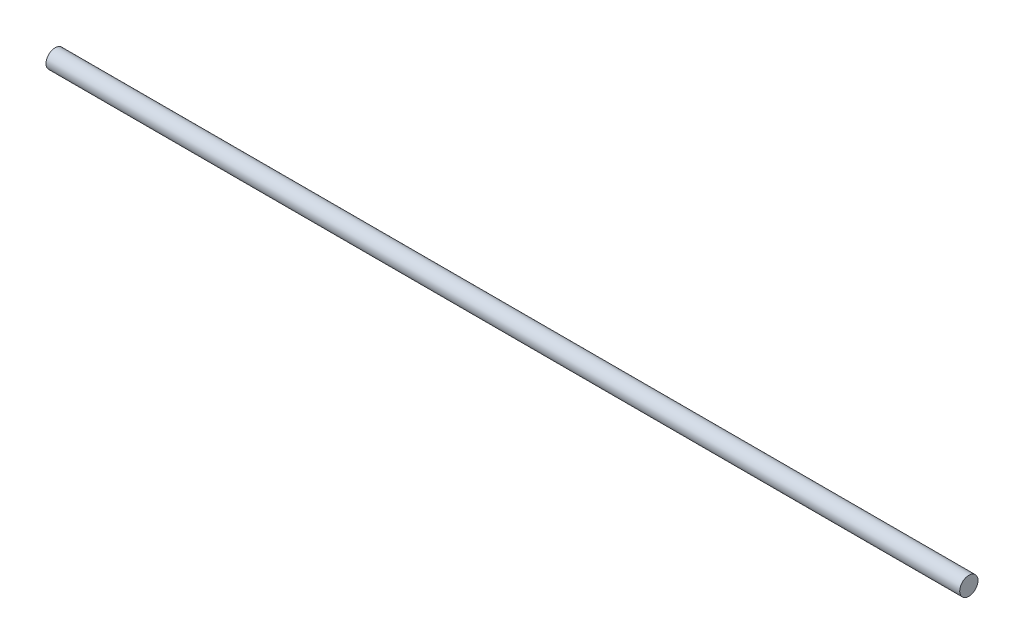
ISO-10303-21;
HEADER;
FILE_DESCRIPTION(('STEP AP214'),'2;1');
FILE_NAME('part.step','',(''),(''),'','','');
FILE_SCHEMA(('AUTOMOTIVE_DESIGN { 1 0 10303 214 1 1 1 1 }'));
ENDSEC;
DATA;
#1=APPLICATION_CONTEXT('core data for automotive mechanical design processes');
#2=APPLICATION_PROTOCOL_DEFINITION('international standard','automotive_design',2000,#1);
#3=PRODUCT_CONTEXT('',#1,'mechanical');
#4=PRODUCT('Part','Part','',(#3));
#5=PRODUCT_RELATED_PRODUCT_CATEGORY('part','',(#4));
#6=PRODUCT_DEFINITION_FORMATION('','',#4);
#7=PRODUCT_DEFINITION_CONTEXT('part definition',#1,'design');
#8=PRODUCT_DEFINITION('design','',#6,#7);
#9=PRODUCT_DEFINITION_SHAPE('','',#8);
#10=(LENGTH_UNIT() NAMED_UNIT(*) SI_UNIT(.MILLI.,.METRE.));
#11=(NAMED_UNIT(*) PLANE_ANGLE_UNIT() SI_UNIT($,.RADIAN.));
#12=(NAMED_UNIT(*) SI_UNIT($,.STERADIAN.) SOLID_ANGLE_UNIT());
#13=UNCERTAINTY_MEASURE_WITH_UNIT(LENGTH_MEASURE(1.E-05),#10,'distance_accuracy_value','');
#14=(GEOMETRIC_REPRESENTATION_CONTEXT(3) GLOBAL_UNCERTAINTY_ASSIGNED_CONTEXT((#13)) GLOBAL_UNIT_ASSIGNED_CONTEXT((#10,
#11,#12)) REPRESENTATION_CONTEXT('',''));
#15=CARTESIAN_POINT('',(0.,0.,0.));
#16=DIRECTION('',(0.,0.,1.));
#17=DIRECTION('',(1.,0.,0.));
#18=AXIS2_PLACEMENT_3D('',#15,#16,#17);
#19=CARTESIAN_POINT('',(0.,0.,0.));
#20=DIRECTION('',(1.,0.,0.));
#21=DIRECTION('',(0.,0.,-1.));
#22=AXIS2_PLACEMENT_3D('',#19,#20,#21);
#23=PLANE('',#22);
#24=CARTESIAN_POINT('',(0.,0.,0.));
#25=DIRECTION('',(1.,0.,0.));
#26=DIRECTION('',(0.,0.,-1.));
#27=AXIS2_PLACEMENT_3D('',#24,#25,#26);
#28=CIRCLE('',#27,6.35);
#29=CARTESIAN_POINT('',(0.,0.,-6.35));
#30=VERTEX_POINT('',#29);
#31=EDGE_CURVE('E45',#30,#30,#28,.T.);
#32=ORIENTED_EDGE('',*,*,#31,.F.);
#33=EDGE_LOOP('',(#32));
#34=FACE_BOUND('',#33,.T.);
#35=ADVANCED_FACE('F38',(#34),#23,.F.);
#36=CARTESIAN_POINT('',(635.,0.,0.));
#37=DIRECTION('',(1.,0.,0.));
#38=DIRECTION('',(0.,0.,-1.));
#39=AXIS2_PLACEMENT_3D('',#36,#37,#38);
#40=PLANE('',#39);
#41=CARTESIAN_POINT('',(635.,0.,0.));
#42=DIRECTION('',(1.,0.,0.));
#43=DIRECTION('',(0.,0.,-1.));
#44=AXIS2_PLACEMENT_3D('',#41,#42,#43);
#45=CIRCLE('',#44,6.35);
#46=CARTESIAN_POINT('',(635.,0.,-6.35));
#47=VERTEX_POINT('',#46);
#48=EDGE_CURVE('E12',#47,#47,#45,.T.);
#49=ORIENTED_EDGE('',*,*,#48,.T.);
#50=EDGE_LOOP('',(#49));
#51=FACE_BOUND('',#50,.T.);
#52=ADVANCED_FACE('F52',(#51),#40,.T.);
#53=CARTESIAN_POINT('',(0.,0.,0.));
#54=DIRECTION('',(1.,0.,0.));
#55=DIRECTION('',(0.,0.,-1.));
#56=AXIS2_PLACEMENT_3D('',#53,#54,#55);
#57=CYLINDRICAL_SURFACE('',#56,6.35);
#58=ORIENTED_EDGE('',*,*,#48,.F.);
#59=EDGE_LOOP('',(#58));
#60=FACE_BOUND('',#59,.T.);
#61=ORIENTED_EDGE('',*,*,#31,.T.);
#62=EDGE_LOOP('',(#61));
#63=FACE_BOUND('',#62,.T.);
#64=ADVANCED_FACE('F54',(#60,#63),#57,.T.);
#65=CLOSED_SHELL('',(#35,#52,#64));
#66=MANIFOLD_SOLID_BREP('B2',#65);
#67=ADVANCED_BREP_SHAPE_REPRESENTATION('',(#18,#66),#14);
#68=SHAPE_DEFINITION_REPRESENTATION(#9,#67);
ENDSEC;
END-ISO-10303-21;
